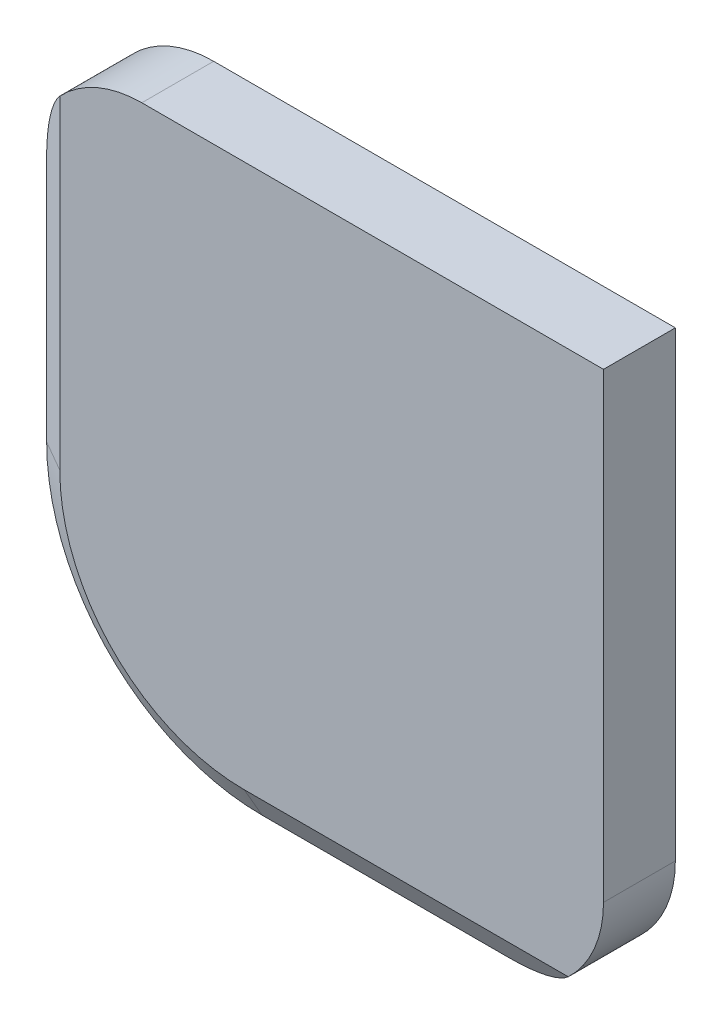
ISO-10303-21;
HEADER;
FILE_DESCRIPTION(('STEP AP214'),'2;1');
FILE_NAME('part.step','',(''),(''),'','','');
FILE_SCHEMA(('AUTOMOTIVE_DESIGN { 1 0 10303 214 1 1 1 1 }'));
ENDSEC;
DATA;
#1=APPLICATION_CONTEXT('core data for automotive mechanical design processes');
#2=APPLICATION_PROTOCOL_DEFINITION('international standard','automotive_design',2000,#1);
#3=PRODUCT_CONTEXT('',#1,'mechanical');
#4=PRODUCT('Part','Part','',(#3));
#5=PRODUCT_RELATED_PRODUCT_CATEGORY('part','',(#4));
#6=PRODUCT_DEFINITION_FORMATION('','',#4);
#7=PRODUCT_DEFINITION_CONTEXT('part definition',#1,'design');
#8=PRODUCT_DEFINITION('design','',#6,#7);
#9=PRODUCT_DEFINITION_SHAPE('','',#8);
#10=(LENGTH_UNIT() NAMED_UNIT(*) SI_UNIT(.MILLI.,.METRE.));
#11=(NAMED_UNIT(*) PLANE_ANGLE_UNIT() SI_UNIT($,.RADIAN.));
#12=(NAMED_UNIT(*) SI_UNIT($,.STERADIAN.) SOLID_ANGLE_UNIT());
#13=UNCERTAINTY_MEASURE_WITH_UNIT(LENGTH_MEASURE(1.E-05),#10,'distance_accuracy_value','');
#14=(GEOMETRIC_REPRESENTATION_CONTEXT(3) GLOBAL_UNCERTAINTY_ASSIGNED_CONTEXT((#13)) GLOBAL_UNIT_ASSIGNED_CONTEXT((#10,
#11,#12)) REPRESENTATION_CONTEXT('',''));
#15=CARTESIAN_POINT('',(0.,0.,0.));
#16=DIRECTION('',(0.,0.,1.));
#17=DIRECTION('',(1.,0.,0.));
#18=AXIS2_PLACEMENT_3D('',#15,#16,#17);
#19=CARTESIAN_POINT('',(0.,0.,6.35));
#20=DIRECTION('',(0.,0.,-1.));
#21=DIRECTION('',(-1.,0.,0.));
#22=AXIS2_PLACEMENT_3D('',#19,#20,#21);
#23=CYLINDRICAL_SURFACE('',#22,19.05);
#24=DIRECTION('',(0.,0.,-1.));
#25=VECTOR('',#24,1.);
#26=CARTESIAN_POINT('',(-19.05,0.,6.35));
#27=LINE('',#26,#25);
#28=CARTESIAN_POINT('',(-19.05,0.,4.76249999999999));
#29=VERTEX_POINT('',#28);
#30=CARTESIAN_POINT('',(-19.05,0.,1.58378725844097));
#31=VERTEX_POINT('',#30);
#32=EDGE_CURVE('E155',#29,#31,#27,.T.);
#33=ORIENTED_EDGE('',*,*,#32,.T.);
#34=CARTESIAN_POINT('',(0.,0.,1.58378725844097));
#35=DIRECTION('',(0.,0.,1.));
#36=DIRECTION('',(1.,0.,0.));
#37=AXIS2_PLACEMENT_3D('',#34,#35,#36);
#38=CIRCLE('',#37,19.05);
#39=CARTESIAN_POINT('',(0.,-19.05,1.58378725844097));
#40=VERTEX_POINT('',#39);
#41=EDGE_CURVE('E213',#31,#40,#38,.T.);
#42=ORIENTED_EDGE('',*,*,#41,.T.);
#43=DIRECTION('',(0.,0.,-1.));
#44=VECTOR('',#43,1.);
#45=CARTESIAN_POINT('',(0.,-19.05,6.35));
#46=LINE('',#45,#44);
#47=CARTESIAN_POINT('',(0.,-19.05,4.76249999999999));
#48=VERTEX_POINT('',#47);
#49=EDGE_CURVE('E154',#48,#40,#46,.T.);
#50=ORIENTED_EDGE('',*,*,#49,.F.);
#51=CARTESIAN_POINT('',(0.,0.,4.76249999999999));
#52=DIRECTION('',(0.,0.,1.));
#53=DIRECTION('',(1.,0.,0.));
#54=AXIS2_PLACEMENT_3D('',#51,#52,#53);
#55=CIRCLE('',#54,19.05);
#56=EDGE_CURVE('E185',#48,#29,#55,.F.);
#57=ORIENTED_EDGE('',*,*,#56,.T.);
#58=EDGE_LOOP('',(#33,#42,#50,#57));
#59=FACE_BOUND('',#58,.T.);
#60=ADVANCED_FACE('F45',(#59),#23,.T.);
#61=CARTESIAN_POINT('',(31.75,-19.05,6.35));
#62=DIRECTION('',(0.,1.,0.));
#63=DIRECTION('',(-1.,0.,0.));
#64=AXIS2_PLACEMENT_3D('',#61,#62,#63);
#65=PLANE('',#64);
#66=DIRECTION('',(1.,0.,0.));
#67=VECTOR('',#66,1.);
#68=CARTESIAN_POINT('',(31.75,-19.05,1.58378725844097));
#69=LINE('',#68,#67);
#70=CARTESIAN_POINT('',(21.75,-19.05,1.58378725844097));
#71=VERTEX_POINT('',#70);
#72=EDGE_CURVE('E191',#40,#71,#69,.T.);
#73=ORIENTED_EDGE('',*,*,#72,.T.);
#74=DIRECTION('',(0.,0.,-1.));
#75=VECTOR('',#74,1.);
#76=CARTESIAN_POINT('',(21.75,-19.05,6.35));
#77=LINE('',#76,#75);
#78=CARTESIAN_POINT('',(21.75,-19.05,4.76249999999999));
#79=VERTEX_POINT('',#78);
#80=EDGE_CURVE('E238',#71,#79,#77,.F.);
#81=ORIENTED_EDGE('',*,*,#80,.T.);
#82=DIRECTION('',(-1.,0.,0.));
#83=VECTOR('',#82,1.);
#84=CARTESIAN_POINT('',(0.,-19.05,4.76249999999999));
#85=LINE('',#84,#83);
#86=EDGE_CURVE('E182',#79,#48,#85,.T.);
#87=ORIENTED_EDGE('',*,*,#86,.T.);
#88=ORIENTED_EDGE('',*,*,#49,.T.);
#89=EDGE_LOOP('',(#73,#81,#87,#88));
#90=FACE_BOUND('',#89,.T.);
#91=ADVANCED_FACE('F283',(#90),#65,.F.);
#92=CARTESIAN_POINT('',(31.75,31.75,6.35));
#93=DIRECTION('',(-1.,0.,0.));
#94=DIRECTION('',(0.,-1.,0.));
#95=AXIS2_PLACEMENT_3D('',#92,#93,#94);
#96=PLANE('',#95);
#97=DIRECTION('',(0.,1.,0.));
#98=VECTOR('',#97,1.);
#99=CARTESIAN_POINT('',(31.75,31.75,6.35));
#100=LINE('',#99,#98);
#101=CARTESIAN_POINT('',(31.75,-9.04999999999999,6.35));
#102=VERTEX_POINT('',#101);
#103=CARTESIAN_POINT('',(31.75,31.75,6.35));
#104=VERTEX_POINT('',#103);
#105=EDGE_CURVE('E130',#102,#104,#100,.T.);
#106=ORIENTED_EDGE('',*,*,#105,.F.);
#107=DIRECTION('',(0.,0.,-1.));
#108=VECTOR('',#107,1.);
#109=CARTESIAN_POINT('',(31.75,-9.04999999999999,6.35));
#110=LINE('',#109,#108);
#111=CARTESIAN_POINT('',(31.75,-9.04999999999999,0.));
#112=VERTEX_POINT('',#111);
#113=EDGE_CURVE('E219',#102,#112,#110,.T.);
#114=ORIENTED_EDGE('',*,*,#113,.T.);
#115=DIRECTION('',(0.,1.,0.));
#116=VECTOR('',#115,1.);
#117=CARTESIAN_POINT('',(31.75,31.75,0.));
#118=LINE('',#117,#116);
#119=CARTESIAN_POINT('',(31.75,31.75,0.));
#120=VERTEX_POINT('',#119);
#121=EDGE_CURVE('E149',#112,#120,#118,.T.);
#122=ORIENTED_EDGE('',*,*,#121,.T.);
#123=DIRECTION('',(0.,0.,-1.));
#124=VECTOR('',#123,1.);
#125=CARTESIAN_POINT('',(31.75,31.75,6.35));
#126=LINE('',#125,#124);
#127=EDGE_CURVE('E146',#104,#120,#126,.T.);
#128=ORIENTED_EDGE('',*,*,#127,.F.);
#129=EDGE_LOOP('',(#106,#114,#122,#128));
#130=FACE_BOUND('',#129,.T.);
#131=ADVANCED_FACE('F147',(#130),#96,.F.);
#132=CARTESIAN_POINT('',(-19.05,31.75,6.35));
#133=DIRECTION('',(0.,-1.,0.));
#134=DIRECTION('',(0.,0.,-1.));
#135=AXIS2_PLACEMENT_3D('',#132,#133,#134);
#136=PLANE('',#135);
#137=DIRECTION('',(-1.,0.,0.));
#138=VECTOR('',#137,1.);
#139=CARTESIAN_POINT('',(-19.05,31.75,0.));
#140=LINE('',#139,#138);
#141=CARTESIAN_POINT('',(-9.05,31.75,0.));
#142=VERTEX_POINT('',#141);
#143=EDGE_CURVE('E143',#120,#142,#140,.T.);
#144=ORIENTED_EDGE('',*,*,#143,.T.);
#145=DIRECTION('',(0.,0.,-1.));
#146=VECTOR('',#145,1.);
#147=CARTESIAN_POINT('',(-9.05,31.75,6.35));
#148=LINE('',#147,#146);
#149=CARTESIAN_POINT('',(-9.05,31.75,6.35));
#150=VERTEX_POINT('',#149);
#151=EDGE_CURVE('E54',#142,#150,#148,.F.);
#152=ORIENTED_EDGE('',*,*,#151,.T.);
#153=DIRECTION('',(-1.,0.,0.));
#154=VECTOR('',#153,1.);
#155=CARTESIAN_POINT('',(-19.05,31.75,6.35));
#156=LINE('',#155,#154);
#157=EDGE_CURVE('E135',#104,#150,#156,.T.);
#158=ORIENTED_EDGE('',*,*,#157,.F.);
#159=ORIENTED_EDGE('',*,*,#127,.T.);
#160=EDGE_LOOP('',(#144,#152,#158,#159));
#161=FACE_BOUND('',#160,.T.);
#162=ADVANCED_FACE('F157',(#161),#136,.F.);
#163=CARTESIAN_POINT('',(-19.05,0.,6.35));
#164=DIRECTION('',(1.,0.,0.));
#165=DIRECTION('',(0.,0.,-1.));
#166=AXIS2_PLACEMENT_3D('',#163,#164,#165);
#167=PLANE('',#166);
#168=DIRECTION('',(0.,1.,0.));
#169=VECTOR('',#168,1.);
#170=CARTESIAN_POINT('',(-19.05,31.75,4.76249999999999));
#171=LINE('',#170,#169);
#172=CARTESIAN_POINT('',(-19.05,21.75,4.76249999999999));
#173=VERTEX_POINT('',#172);
#174=EDGE_CURVE('E188',#29,#173,#171,.T.);
#175=ORIENTED_EDGE('',*,*,#174,.T.);
#176=DIRECTION('',(0.,0.,-1.));
#177=VECTOR('',#176,1.);
#178=CARTESIAN_POINT('',(-19.05,21.75,6.35));
#179=LINE('',#178,#177);
#180=CARTESIAN_POINT('',(-19.05,21.75,1.58378725844097));
#181=VERTEX_POINT('',#180);
#182=EDGE_CURVE('E249',#173,#181,#179,.T.);
#183=ORIENTED_EDGE('',*,*,#182,.T.);
#184=DIRECTION('',(0.,-1.,0.));
#185=VECTOR('',#184,1.);
#186=CARTESIAN_POINT('',(-19.05,0.,1.58378725844097));
#187=LINE('',#186,#185);
#188=EDGE_CURVE('E216',#181,#31,#187,.T.);
#189=ORIENTED_EDGE('',*,*,#188,.T.);
#190=ORIENTED_EDGE('',*,*,#32,.F.);
#191=EDGE_LOOP('',(#175,#183,#189,#190));
#192=FACE_BOUND('',#191,.T.);
#193=ADVANCED_FACE('F308',(#192),#167,.F.);
#194=CARTESIAN_POINT('',(0.,0.,6.35));
#195=DIRECTION('',(0.,0.,1.));
#196=DIRECTION('',(1.,0.,0.));
#197=AXIS2_PLACEMENT_3D('',#194,#195,#196);
#198=PLANE('',#197);
#199=DIRECTION('',(1.,0.,0.));
#200=VECTOR('',#199,1.);
#201=CARTESIAN_POINT('',(31.75,-16.3003693429844,6.35));
#202=LINE('',#201,#200);
#203=CARTESIAN_POINT('',(0.,-16.3003693429844,6.35));
#204=VERTEX_POINT('',#203);
#205=CARTESIAN_POINT('',(28.6370998533716,-16.3003693429844,6.35));
#206=VERTEX_POINT('',#205);
#207=EDGE_CURVE('E179',#204,#206,#202,.T.);
#208=ORIENTED_EDGE('',*,*,#207,.T.);
#209=CARTESIAN_POINT('',(21.75,-9.04999999999999,6.35));
#210=DIRECTION('',(0.,0.,1.));
#211=DIRECTION('',(1.,0.,0.));
#212=AXIS2_PLACEMENT_3D('',#209,#210,#211);
#213=CIRCLE('',#212,10.);
#214=EDGE_CURVE('E138',#206,#102,#213,.T.);
#215=ORIENTED_EDGE('',*,*,#214,.T.);
#216=ORIENTED_EDGE('',*,*,#105,.T.);
#217=ORIENTED_EDGE('',*,*,#157,.T.);
#218=CARTESIAN_POINT('',(-9.05,21.75,6.35));
#219=DIRECTION('',(0.,0.,1.));
#220=DIRECTION('',(1.,0.,0.));
#221=AXIS2_PLACEMENT_3D('',#218,#219,#220);
#222=CIRCLE('',#221,10.);
#223=CARTESIAN_POINT('',(-16.3003693429844,28.6370998533716,6.35));
#224=VERTEX_POINT('',#223);
#225=EDGE_CURVE('E244',#150,#224,#222,.T.);
#226=ORIENTED_EDGE('',*,*,#225,.T.);
#227=DIRECTION('',(0.,-1.,0.));
#228=VECTOR('',#227,1.);
#229=CARTESIAN_POINT('',(-16.3003693429844,0.,6.35));
#230=LINE('',#229,#228);
#231=CARTESIAN_POINT('',(-16.3003693429844,0.,6.35));
#232=VERTEX_POINT('',#231);
#233=EDGE_CURVE('E173',#224,#232,#230,.T.);
#234=ORIENTED_EDGE('',*,*,#233,.T.);
#235=CARTESIAN_POINT('',(0.,0.,6.35));
#236=DIRECTION('',(0.,0.,1.));
#237=DIRECTION('',(1.,0.,0.));
#238=AXIS2_PLACEMENT_3D('',#235,#236,#237);
#239=CIRCLE('',#238,16.3003693429844);
#240=EDGE_CURVE('E176',#232,#204,#239,.T.);
#241=ORIENTED_EDGE('',*,*,#240,.T.);
#242=EDGE_LOOP('',(#208,#215,#216,#217,#226,#234,#241));
#243=FACE_BOUND('',#242,.T.);
#244=ADVANCED_FACE('F133',(#243),#198,.T.);
#245=CARTESIAN_POINT('',(0.,0.,0.));
#246=DIRECTION('',(0.,0.,1.));
#247=DIRECTION('',(1.,0.,0.));
#248=AXIS2_PLACEMENT_3D('',#245,#246,#247);
#249=PLANE('',#248);
#250=ORIENTED_EDGE('',*,*,#121,.F.);
#251=CARTESIAN_POINT('',(21.75,-9.04999999999999,0.));
#252=DIRECTION('',(0.,0.,1.));
#253=DIRECTION('',(1.,0.,0.));
#254=AXIS2_PLACEMENT_3D('',#251,#252,#253);
#255=CIRCLE('',#254,10.);
#256=CARTESIAN_POINT('',(28.6303236668052,-16.3068,0.));
#257=VERTEX_POINT('',#256);
#258=EDGE_CURVE('E232',#112,#257,#255,.F.);
#259=ORIENTED_EDGE('',*,*,#258,.T.);
#260=DIRECTION('',(-1.,0.,0.));
#261=VECTOR('',#260,1.);
#262=CARTESIAN_POINT('',(0.,-16.3068,0.));
#263=LINE('',#262,#261);
#264=CARTESIAN_POINT('',(0.,-16.3068,0.));
#265=VERTEX_POINT('',#264);
#266=EDGE_CURVE('E210',#257,#265,#263,.T.);
#267=ORIENTED_EDGE('',*,*,#266,.T.);
#268=CARTESIAN_POINT('',(0.,0.,0.));
#269=DIRECTION('',(0.,0.,1.));
#270=DIRECTION('',(1.,0.,0.));
#271=AXIS2_PLACEMENT_3D('',#268,#269,#270);
#272=CIRCLE('',#271,16.3068);
#273=CARTESIAN_POINT('',(-16.3068,0.,0.));
#274=VERTEX_POINT('',#273);
#275=EDGE_CURVE('E207',#265,#274,#272,.F.);
#276=ORIENTED_EDGE('',*,*,#275,.T.);
#277=DIRECTION('',(0.,1.,0.));
#278=VECTOR('',#277,1.);
#279=CARTESIAN_POINT('',(-16.3068,0.,0.));
#280=LINE('',#279,#278);
#281=CARTESIAN_POINT('',(-16.3068,28.6303236668052,0.));
#282=VERTEX_POINT('',#281);
#283=EDGE_CURVE('E203',#274,#282,#280,.T.);
#284=ORIENTED_EDGE('',*,*,#283,.T.);
#285=CARTESIAN_POINT('',(-9.05,21.75,0.));
#286=DIRECTION('',(0.,0.,1.));
#287=DIRECTION('',(1.,0.,0.));
#288=AXIS2_PLACEMENT_3D('',#285,#286,#287);
#289=CIRCLE('',#288,10.);
#290=EDGE_CURVE('E229',#282,#142,#289,.F.);
#291=ORIENTED_EDGE('',*,*,#290,.T.);
#292=ORIENTED_EDGE('',*,*,#143,.F.);
#293=EDGE_LOOP('',(#250,#259,#267,#276,#284,#291,#292));
#294=FACE_BOUND('',#293,.T.);
#295=ADVANCED_FACE('F260',(#294),#249,.F.);
#296=CARTESIAN_POINT('',(-16.3003693429844,0.,6.35));
#297=DIRECTION('',(-0.500000000000002,0.,0.866025403784437));
#298=DIRECTION('',(0.,1.,0.));
#299=AXIS2_PLACEMENT_3D('',#296,#297,#298);
#300=PLANE('',#299);
#301=ORIENTED_EDGE('',*,*,#233,.F.);
#302=CARTESIAN_POINT('',(-9.05,21.75,10.5360026918963));
#303=DIRECTION('',(-0.500000000000002,0.,0.866025403784437));
#304=DIRECTION('',(-0.866025403784437,0.,-0.500000000000003));
#305=AXIS2_PLACEMENT_3D('',#302,#303,#304);
#306=ELLIPSE('',#305,11.5470053837925,10.);
#307=EDGE_CURVE('E11',#224,#173,#306,.T.);
#308=ORIENTED_EDGE('',*,*,#307,.T.);
#309=ORIENTED_EDGE('',*,*,#174,.F.);
#310=DIRECTION('',(-0.866025403784437,0.,-0.500000000000002));
#311=VECTOR('',#310,1.);
#312=CARTESIAN_POINT('',(-16.3003693429844,0.,6.35));
#313=LINE('',#312,#311);
#314=EDGE_CURVE('E167',#232,#29,#313,.T.);
#315=ORIENTED_EDGE('',*,*,#314,.F.);
#316=EDGE_LOOP('',(#301,#308,#309,#315));
#317=FACE_BOUND('',#316,.T.);
#318=ADVANCED_FACE('F263',(#317),#300,.T.);
#319=CARTESIAN_POINT('',(0.,0.,6.35));
#320=DIRECTION('',(0.,0.,-1.));
#321=DIRECTION('',(-1.,0.,0.));
#322=AXIS2_PLACEMENT_3D('',#319,#320,#321);
#323=CONICAL_SURFACE('',#322,16.3003693429844,1.04719755119659);
#324=ORIENTED_EDGE('',*,*,#314,.T.);
#325=ORIENTED_EDGE('',*,*,#56,.F.);
#326=DIRECTION('',(0.,-0.866025403784437,-0.500000000000002));
#327=VECTOR('',#326,1.);
#328=CARTESIAN_POINT('',(0.,-16.3003693429844,6.35));
#329=LINE('',#328,#327);
#330=EDGE_CURVE('E192',#204,#48,#329,.T.);
#331=ORIENTED_EDGE('',*,*,#330,.F.);
#332=ORIENTED_EDGE('',*,*,#240,.F.);
#333=EDGE_LOOP('',(#324,#325,#331,#332));
#334=FACE_BOUND('',#333,.T.);
#335=ADVANCED_FACE('F268',(#334),#323,.T.);
#336=CARTESIAN_POINT('',(0.,-16.3003693429844,6.35));
#337=DIRECTION('',(0.,-0.500000000000002,0.866025403784437));
#338=DIRECTION('',(-1.,0.,0.));
#339=AXIS2_PLACEMENT_3D('',#336,#337,#338);
#340=PLANE('',#339);
#341=ORIENTED_EDGE('',*,*,#86,.F.);
#342=CARTESIAN_POINT('',(21.75,-9.04999999999999,10.5360026918963));
#343=DIRECTION('',(0.,-0.500000000000002,0.866025403784437));
#344=DIRECTION('',(0.,-0.866025403784437,-0.500000000000003));
#345=AXIS2_PLACEMENT_3D('',#342,#343,#344);
#346=ELLIPSE('',#345,11.5470053837925,10.);
#347=EDGE_CURVE('E241',#79,#206,#346,.T.);
#348=ORIENTED_EDGE('',*,*,#347,.T.);
#349=ORIENTED_EDGE('',*,*,#207,.F.);
#350=ORIENTED_EDGE('',*,*,#330,.T.);
#351=EDGE_LOOP('',(#341,#348,#349,#350));
#352=FACE_BOUND('',#351,.T.);
#353=ADVANCED_FACE('F285',(#352),#340,.T.);
#354=CARTESIAN_POINT('',(-19.05,0.,1.58378725844097));
#355=DIRECTION('',(0.499999999999997,0.,0.86602540378444));
#356=DIRECTION('',(0.,-1.,0.));
#357=AXIS2_PLACEMENT_3D('',#354,#355,#356);
#358=PLANE('',#357);
#359=ORIENTED_EDGE('',*,*,#188,.F.);
#360=CARTESIAN_POINT('',(-9.05,21.75,-4.18971543345524));
#361=DIRECTION('',(0.499999999999997,0.,0.86602540378444));
#362=DIRECTION('',(0.86602540378444,0.,-0.499999999999997));
#363=AXIS2_PLACEMENT_3D('',#360,#361,#362);
#364=ELLIPSE('',#363,11.5470053837925,10.);
#365=EDGE_CURVE('E67',#181,#282,#364,.F.);
#366=ORIENTED_EDGE('',*,*,#365,.T.);
#367=ORIENTED_EDGE('',*,*,#283,.F.);
#368=DIRECTION('',(0.86602540378444,0.,-0.499999999999997));
#369=VECTOR('',#368,1.);
#370=CARTESIAN_POINT('',(-19.05,0.,1.58378725844097));
#371=LINE('',#370,#369);
#372=EDGE_CURVE('E196',#31,#274,#371,.T.);
#373=ORIENTED_EDGE('',*,*,#372,.F.);
#374=EDGE_LOOP('',(#359,#366,#367,#373));
#375=FACE_BOUND('',#374,.T.);
#376=ADVANCED_FACE('F257',(#375),#358,.F.);
#377=CARTESIAN_POINT('',(0.,0.,1.58378725844097));
#378=DIRECTION('',(0.,0.,1.));
#379=DIRECTION('',(1.,0.,0.));
#380=AXIS2_PLACEMENT_3D('',#377,#378,#379);
#381=CONICAL_SURFACE('',#380,19.05,1.0471975511966);
#382=ORIENTED_EDGE('',*,*,#372,.T.);
#383=ORIENTED_EDGE('',*,*,#275,.F.);
#384=DIRECTION('',(0.,0.86602540378444,-0.499999999999997));
#385=VECTOR('',#384,1.);
#386=CARTESIAN_POINT('',(0.,-19.05,1.58378725844097));
#387=LINE('',#386,#385);
#388=EDGE_CURVE('E220',#40,#265,#387,.T.);
#389=ORIENTED_EDGE('',*,*,#388,.F.);
#390=ORIENTED_EDGE('',*,*,#41,.F.);
#391=EDGE_LOOP('',(#382,#383,#389,#390));
#392=FACE_BOUND('',#391,.T.);
#393=ADVANCED_FACE('F292',(#392),#381,.T.);
#394=CARTESIAN_POINT('',(31.75,-19.05,1.58378725844097));
#395=DIRECTION('',(0.,0.499999999999997,0.86602540378444));
#396=DIRECTION('',(1.,0.,0.));
#397=AXIS2_PLACEMENT_3D('',#394,#395,#396);
#398=PLANE('',#397);
#399=ORIENTED_EDGE('',*,*,#266,.F.);
#400=CARTESIAN_POINT('',(21.75,-9.04999999999999,-4.18971543345524));
#401=DIRECTION('',(0.,0.499999999999997,0.86602540378444));
#402=DIRECTION('',(0.,0.86602540378444,-0.499999999999997));
#403=AXIS2_PLACEMENT_3D('',#400,#401,#402);
#404=ELLIPSE('',#403,11.5470053837925,10.);
#405=EDGE_CURVE('E235',#257,#71,#404,.F.);
#406=ORIENTED_EDGE('',*,*,#405,.T.);
#407=ORIENTED_EDGE('',*,*,#72,.F.);
#408=ORIENTED_EDGE('',*,*,#388,.T.);
#409=EDGE_LOOP('',(#399,#406,#407,#408));
#410=FACE_BOUND('',#409,.T.);
#411=ADVANCED_FACE('F278',(#410),#398,.F.);
#412=CARTESIAN_POINT('',(21.75,-9.04999999999999,6.35));
#413=DIRECTION('',(0.,0.,-1.));
#414=DIRECTION('',(-1.,0.,0.));
#415=AXIS2_PLACEMENT_3D('',#412,#413,#414);
#416=CYLINDRICAL_SURFACE('',#415,10.);
#417=ORIENTED_EDGE('',*,*,#347,.F.);
#418=ORIENTED_EDGE('',*,*,#80,.F.);
#419=ORIENTED_EDGE('',*,*,#405,.F.);
#420=ORIENTED_EDGE('',*,*,#258,.F.);
#421=ORIENTED_EDGE('',*,*,#113,.F.);
#422=ORIENTED_EDGE('',*,*,#214,.F.);
#423=EDGE_LOOP('',(#417,#418,#419,#420,#421,#422));
#424=FACE_BOUND('',#423,.T.);
#425=ADVANCED_FACE('F273',(#424),#416,.T.);
#426=CARTESIAN_POINT('',(-9.05,21.75,6.35));
#427=DIRECTION('',(0.,0.,-1.));
#428=DIRECTION('',(-1.,0.,0.));
#429=AXIS2_PLACEMENT_3D('',#426,#427,#428);
#430=CYLINDRICAL_SURFACE('',#429,10.);
#431=ORIENTED_EDGE('',*,*,#225,.F.);
#432=ORIENTED_EDGE('',*,*,#151,.F.);
#433=ORIENTED_EDGE('',*,*,#290,.F.);
#434=ORIENTED_EDGE('',*,*,#365,.F.);
#435=ORIENTED_EDGE('',*,*,#182,.F.);
#436=ORIENTED_EDGE('',*,*,#307,.F.);
#437=EDGE_LOOP('',(#431,#432,#433,#434,#435,#436));
#438=FACE_BOUND('',#437,.T.);
#439=ADVANCED_FACE('F47',(#438),#430,.T.);
#440=CLOSED_SHELL('',(#60,#91,#131,#162,#193,#244,#295,#318,#335,#353,#376,#393,#411,#425,#439));
#441=MANIFOLD_SOLID_BREP('B2',#440);
#442=ADVANCED_BREP_SHAPE_REPRESENTATION('',(#18,#441),#14);
#443=SHAPE_DEFINITION_REPRESENTATION(#9,#442);
ENDSEC;
END-ISO-10303-21;
